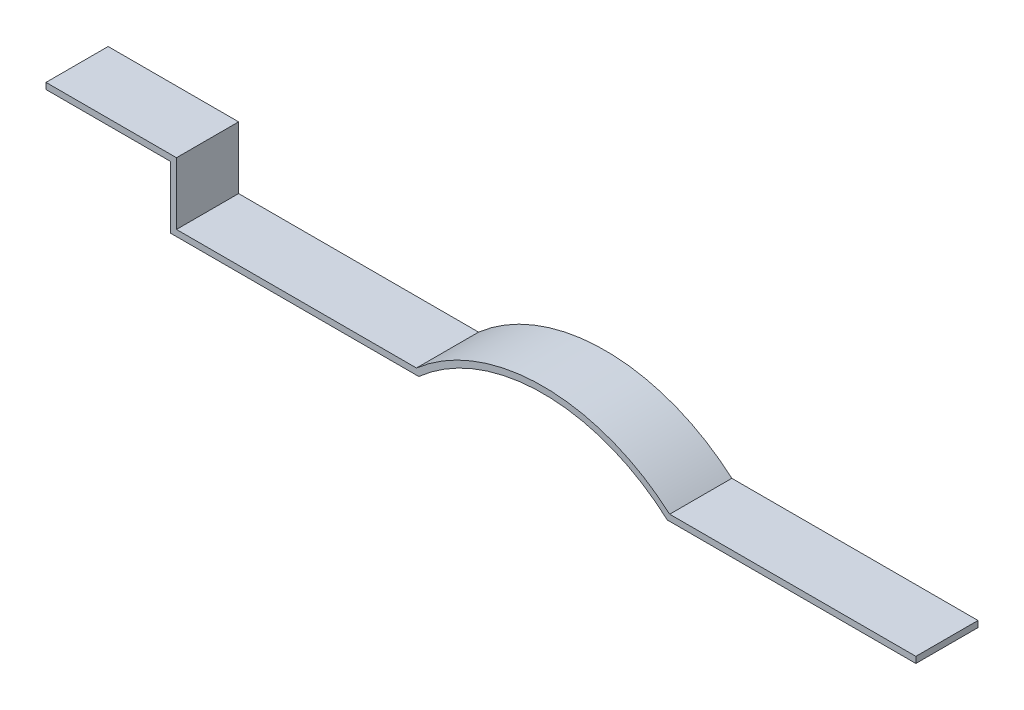
ISO-10303-21;
HEADER;
FILE_DESCRIPTION(('STEP AP214'),'2;1');
FILE_NAME('part.step','',(''),(''),'','','');
FILE_SCHEMA(('AUTOMOTIVE_DESIGN { 1 0 10303 214 1 1 1 1 }'));
ENDSEC;
DATA;
#1=APPLICATION_CONTEXT('core data for automotive mechanical design processes');
#2=APPLICATION_PROTOCOL_DEFINITION('international standard','automotive_design',2000,#1);
#3=PRODUCT_CONTEXT('',#1,'mechanical');
#4=PRODUCT('Part','Part','',(#3));
#5=PRODUCT_RELATED_PRODUCT_CATEGORY('part','',(#4));
#6=PRODUCT_DEFINITION_FORMATION('','',#4);
#7=PRODUCT_DEFINITION_CONTEXT('part definition',#1,'design');
#8=PRODUCT_DEFINITION('design','',#6,#7);
#9=PRODUCT_DEFINITION_SHAPE('','',#8);
#10=(LENGTH_UNIT() NAMED_UNIT(*) SI_UNIT(.MILLI.,.METRE.));
#11=(NAMED_UNIT(*) PLANE_ANGLE_UNIT() SI_UNIT($,.RADIAN.));
#12=(NAMED_UNIT(*) SI_UNIT($,.STERADIAN.) SOLID_ANGLE_UNIT());
#13=UNCERTAINTY_MEASURE_WITH_UNIT(LENGTH_MEASURE(1.E-05),#10,'distance_accuracy_value','');
#14=(GEOMETRIC_REPRESENTATION_CONTEXT(3) GLOBAL_UNCERTAINTY_ASSIGNED_CONTEXT((#13)) GLOBAL_UNIT_ASSIGNED_CONTEXT((#10,
#11,#12)) REPRESENTATION_CONTEXT('',''));
#15=CARTESIAN_POINT('',(0.,0.,0.));
#16=DIRECTION('',(0.,0.,1.));
#17=DIRECTION('',(1.,0.,0.));
#18=AXIS2_PLACEMENT_3D('',#15,#16,#17);
#19=CARTESIAN_POINT('',(0.,5.,50.));
#20=DIRECTION('',(-1.,0.,0.));
#21=DIRECTION('',(0.,0.,1.));
#22=AXIS2_PLACEMENT_3D('',#19,#20,#21);
#23=PLANE('',#22);
#24=DIRECTION('',(0.,1.,0.));
#25=VECTOR('',#24,1.);
#26=CARTESIAN_POINT('',(0.,5.,0.));
#27=LINE('',#26,#25);
#28=CARTESIAN_POINT('',(0.,0.,0.));
#29=VERTEX_POINT('',#28);
#30=CARTESIAN_POINT('',(0.,5.,0.));
#31=VERTEX_POINT('',#30);
#32=EDGE_CURVE('E167',#29,#31,#27,.T.);
#33=ORIENTED_EDGE('',*,*,#32,.T.);
#34=DIRECTION('',(0.,0.,-1.));
#35=VECTOR('',#34,1.);
#36=CARTESIAN_POINT('',(0.,5.,50.));
#37=LINE('',#36,#35);
#38=CARTESIAN_POINT('',(0.,5.,50.));
#39=VERTEX_POINT('',#38);
#40=EDGE_CURVE('E11',#39,#31,#37,.T.);
#41=ORIENTED_EDGE('',*,*,#40,.F.);
#42=DIRECTION('',(0.,1.,0.));
#43=VECTOR('',#42,1.);
#44=CARTESIAN_POINT('',(0.,5.,50.));
#45=LINE('',#44,#43);
#46=CARTESIAN_POINT('',(0.,0.,50.));
#47=VERTEX_POINT('',#46);
#48=EDGE_CURVE('E201',#47,#39,#45,.T.);
#49=ORIENTED_EDGE('',*,*,#48,.F.);
#50=DIRECTION('',(0.,0.,-1.));
#51=VECTOR('',#50,1.);
#52=CARTESIAN_POINT('',(0.,0.,50.));
#53=LINE('',#52,#51);
#54=EDGE_CURVE('E163',#47,#29,#53,.T.);
#55=ORIENTED_EDGE('',*,*,#54,.T.);
#56=EDGE_LOOP('',(#33,#41,#49,#55));
#57=FACE_BOUND('',#56,.T.);
#58=ADVANCED_FACE('F42',(#57),#23,.F.);
#59=CARTESIAN_POINT('',(0.,5.,50.));
#60=DIRECTION('',(0.,-1.,0.));
#61=DIRECTION('',(1.,0.,0.));
#62=AXIS2_PLACEMENT_3D('',#59,#60,#61);
#63=PLANE('',#62);
#64=DIRECTION('',(-1.,0.,0.));
#65=VECTOR('',#64,1.);
#66=CARTESIAN_POINT('',(0.,5.,0.));
#67=LINE('',#66,#65);
#68=CARTESIAN_POINT('',(-198.108066996204,4.99999999999999,0.));
#69=VERTEX_POINT('',#68);
#70=EDGE_CURVE('E171',#31,#69,#67,.T.);
#71=ORIENTED_EDGE('',*,*,#70,.T.);
#72=DIRECTION('',(0.,0.,-1.));
#73=VECTOR('',#72,1.);
#74=CARTESIAN_POINT('',(-198.108066996204,4.99999999999999,50.));
#75=LINE('',#74,#73);
#76=CARTESIAN_POINT('',(-198.108066996204,4.99999999999999,50.));
#77=VERTEX_POINT('',#76);
#78=EDGE_CURVE('E51',#77,#69,#75,.T.);
#79=ORIENTED_EDGE('',*,*,#78,.F.);
#80=DIRECTION('',(-1.,0.,0.));
#81=VECTOR('',#80,1.);
#82=CARTESIAN_POINT('',(0.,5.,50.));
#83=LINE('',#82,#81);
#84=EDGE_CURVE('E114',#39,#77,#83,.T.);
#85=ORIENTED_EDGE('',*,*,#84,.F.);
#86=ORIENTED_EDGE('',*,*,#40,.T.);
#87=EDGE_LOOP('',(#71,#79,#85,#86));
#88=FACE_BOUND('',#87,.T.);
#89=ADVANCED_FACE('F295',(#88),#63,.F.);
#90=CARTESIAN_POINT('',(-300.,-111.803398874989,50.));
#91=DIRECTION('',(0.,0.,-1.));
#92=DIRECTION('',(-1.,0.,0.));
#93=AXIS2_PLACEMENT_3D('',#90,#91,#92);
#94=CYLINDRICAL_SURFACE('',#93,155.);
#95=CARTESIAN_POINT('',(-300.,-111.803398874989,0.));
#96=DIRECTION('',(0.,0.,1.));
#97=DIRECTION('',(-1.,0.,0.));
#98=AXIS2_PLACEMENT_3D('',#95,#96,#97);
#99=CIRCLE('',#98,155.);
#100=CARTESIAN_POINT('',(-401.891933003796,5.,0.));
#101=VERTEX_POINT('',#100);
#102=EDGE_CURVE('E174',#69,#101,#99,.T.);
#103=ORIENTED_EDGE('',*,*,#102,.T.);
#104=DIRECTION('',(0.,0.,-1.));
#105=VECTOR('',#104,1.);
#106=CARTESIAN_POINT('',(-401.891933003796,5.,50.));
#107=LINE('',#106,#105);
#108=CARTESIAN_POINT('',(-401.891933003796,5.,50.));
#109=VERTEX_POINT('',#108);
#110=EDGE_CURVE('E228',#109,#101,#107,.T.);
#111=ORIENTED_EDGE('',*,*,#110,.F.);
#112=CARTESIAN_POINT('',(-300.,-111.803398874989,50.));
#113=DIRECTION('',(0.,0.,1.));
#114=DIRECTION('',(-1.,0.,0.));
#115=AXIS2_PLACEMENT_3D('',#112,#113,#114);
#116=CIRCLE('',#115,155.);
#117=EDGE_CURVE('E238',#77,#109,#116,.T.);
#118=ORIENTED_EDGE('',*,*,#117,.F.);
#119=ORIENTED_EDGE('',*,*,#78,.T.);
#120=EDGE_LOOP('',(#103,#111,#118,#119));
#121=FACE_BOUND('',#120,.T.);
#122=ADVANCED_FACE('F236',(#121),#94,.T.);
#123=CARTESIAN_POINT('',(-401.891933003796,5.,50.));
#124=DIRECTION('',(0.,-1.,0.));
#125=DIRECTION('',(1.,0.,0.));
#126=AXIS2_PLACEMENT_3D('',#123,#124,#125);
#127=PLANE('',#126);
#128=DIRECTION('',(-1.,0.,0.));
#129=VECTOR('',#128,1.);
#130=CARTESIAN_POINT('',(-401.891933003796,5.,0.));
#131=LINE('',#130,#129);
#132=CARTESIAN_POINT('',(-595.,5.,0.));
#133=VERTEX_POINT('',#132);
#134=EDGE_CURVE('E177',#101,#133,#131,.T.);
#135=ORIENTED_EDGE('',*,*,#134,.T.);
#136=DIRECTION('',(0.,0.,-1.));
#137=VECTOR('',#136,1.);
#138=CARTESIAN_POINT('',(-595.,5.,50.));
#139=LINE('',#138,#137);
#140=CARTESIAN_POINT('',(-595.,5.,50.));
#141=VERTEX_POINT('',#140);
#142=EDGE_CURVE('E224',#141,#133,#139,.T.);
#143=ORIENTED_EDGE('',*,*,#142,.F.);
#144=DIRECTION('',(-1.,0.,0.));
#145=VECTOR('',#144,1.);
#146=CARTESIAN_POINT('',(-401.891933003796,5.,50.));
#147=LINE('',#146,#145);
#148=EDGE_CURVE('E257',#109,#141,#147,.T.);
#149=ORIENTED_EDGE('',*,*,#148,.F.);
#150=ORIENTED_EDGE('',*,*,#110,.T.);
#151=EDGE_LOOP('',(#135,#143,#149,#150));
#152=FACE_BOUND('',#151,.T.);
#153=ADVANCED_FACE('F247',(#152),#127,.F.);
#154=CARTESIAN_POINT('',(-595.,5.,50.));
#155=DIRECTION('',(-1.,0.,0.));
#156=DIRECTION('',(0.,0.,1.));
#157=AXIS2_PLACEMENT_3D('',#154,#155,#156);
#158=PLANE('',#157);
#159=DIRECTION('',(0.,1.,0.));
#160=VECTOR('',#159,1.);
#161=CARTESIAN_POINT('',(-595.,5.,0.));
#162=LINE('',#161,#160);
#163=CARTESIAN_POINT('',(-595.,55.,0.));
#164=VERTEX_POINT('',#163);
#165=EDGE_CURVE('E180',#133,#164,#162,.T.);
#166=ORIENTED_EDGE('',*,*,#165,.T.);
#167=DIRECTION('',(0.,0.,-1.));
#168=VECTOR('',#167,1.);
#169=CARTESIAN_POINT('',(-595.,55.,50.));
#170=LINE('',#169,#168);
#171=CARTESIAN_POINT('',(-595.,55.,50.));
#172=VERTEX_POINT('',#171);
#173=EDGE_CURVE('E220',#172,#164,#170,.T.);
#174=ORIENTED_EDGE('',*,*,#173,.F.);
#175=DIRECTION('',(0.,1.,0.));
#176=VECTOR('',#175,1.);
#177=CARTESIAN_POINT('',(-595.,5.,50.));
#178=LINE('',#177,#176);
#179=EDGE_CURVE('E253',#141,#172,#178,.T.);
#180=ORIENTED_EDGE('',*,*,#179,.F.);
#181=ORIENTED_EDGE('',*,*,#142,.T.);
#182=EDGE_LOOP('',(#166,#174,#180,#181));
#183=FACE_BOUND('',#182,.T.);
#184=ADVANCED_FACE('F251',(#183),#158,.F.);
#185=CARTESIAN_POINT('',(-595.,55.,50.));
#186=DIRECTION('',(0.,-1.,0.));
#187=DIRECTION('',(1.,0.,0.));
#188=AXIS2_PLACEMENT_3D('',#185,#186,#187);
#189=PLANE('',#188);
#190=DIRECTION('',(-1.,0.,0.));
#191=VECTOR('',#190,1.);
#192=CARTESIAN_POINT('',(-595.,55.,0.));
#193=LINE('',#192,#191);
#194=CARTESIAN_POINT('',(-700.,55.,0.));
#195=VERTEX_POINT('',#194);
#196=EDGE_CURVE('E183',#164,#195,#193,.T.);
#197=ORIENTED_EDGE('',*,*,#196,.T.);
#198=DIRECTION('',(0.,0.,-1.));
#199=VECTOR('',#198,1.);
#200=CARTESIAN_POINT('',(-700.,55.,50.));
#201=LINE('',#200,#199);
#202=CARTESIAN_POINT('',(-700.,55.,50.));
#203=VERTEX_POINT('',#202);
#204=EDGE_CURVE('E216',#203,#195,#201,.T.);
#205=ORIENTED_EDGE('',*,*,#204,.F.);
#206=DIRECTION('',(-1.,0.,0.));
#207=VECTOR('',#206,1.);
#208=CARTESIAN_POINT('',(-595.,55.,50.));
#209=LINE('',#208,#207);
#210=EDGE_CURVE('E256',#172,#203,#209,.T.);
#211=ORIENTED_EDGE('',*,*,#210,.F.);
#212=ORIENTED_EDGE('',*,*,#173,.T.);
#213=EDGE_LOOP('',(#197,#205,#211,#212));
#214=FACE_BOUND('',#213,.T.);
#215=ADVANCED_FACE('F308',(#214),#189,.F.);
#216=CARTESIAN_POINT('',(-700.,50.,50.));
#217=DIRECTION('',(1.,0.,0.));
#218=DIRECTION('',(0.,0.,-1.));
#219=AXIS2_PLACEMENT_3D('',#216,#217,#218);
#220=PLANE('',#219);
#221=DIRECTION('',(0.,-1.,0.));
#222=VECTOR('',#221,1.);
#223=CARTESIAN_POINT('',(-700.,50.,0.));
#224=LINE('',#223,#222);
#225=CARTESIAN_POINT('',(-700.,50.,0.));
#226=VERTEX_POINT('',#225);
#227=EDGE_CURVE('E186',#195,#226,#224,.T.);
#228=ORIENTED_EDGE('',*,*,#227,.T.);
#229=DIRECTION('',(0.,0.,-1.));
#230=VECTOR('',#229,1.);
#231=CARTESIAN_POINT('',(-700.,50.,50.));
#232=LINE('',#231,#230);
#233=CARTESIAN_POINT('',(-700.,50.,50.));
#234=VERTEX_POINT('',#233);
#235=EDGE_CURVE('E212',#234,#226,#232,.T.);
#236=ORIENTED_EDGE('',*,*,#235,.F.);
#237=DIRECTION('',(0.,-1.,0.));
#238=VECTOR('',#237,1.);
#239=CARTESIAN_POINT('',(-700.,50.,50.));
#240=LINE('',#239,#238);
#241=EDGE_CURVE('E261',#203,#234,#240,.T.);
#242=ORIENTED_EDGE('',*,*,#241,.F.);
#243=ORIENTED_EDGE('',*,*,#204,.T.);
#244=EDGE_LOOP('',(#228,#236,#242,#243));
#245=FACE_BOUND('',#244,.T.);
#246=ADVANCED_FACE('F311',(#245),#220,.F.);
#247=CARTESIAN_POINT('',(-600.,50.,50.));
#248=DIRECTION('',(0.,1.,0.));
#249=DIRECTION('',(-1.,0.,0.));
#250=AXIS2_PLACEMENT_3D('',#247,#248,#249);
#251=PLANE('',#250);
#252=DIRECTION('',(1.,0.,0.));
#253=VECTOR('',#252,1.);
#254=CARTESIAN_POINT('',(-600.,50.,0.));
#255=LINE('',#254,#253);
#256=CARTESIAN_POINT('',(-600.,50.,0.));
#257=VERTEX_POINT('',#256);
#258=EDGE_CURVE('E189',#226,#257,#255,.T.);
#259=ORIENTED_EDGE('',*,*,#258,.T.);
#260=DIRECTION('',(0.,0.,-1.));
#261=VECTOR('',#260,1.);
#262=CARTESIAN_POINT('',(-600.,50.,50.));
#263=LINE('',#262,#261);
#264=CARTESIAN_POINT('',(-600.,50.,50.));
#265=VERTEX_POINT('',#264);
#266=EDGE_CURVE('E208',#265,#257,#263,.T.);
#267=ORIENTED_EDGE('',*,*,#266,.F.);
#268=DIRECTION('',(1.,0.,0.));
#269=VECTOR('',#268,1.);
#270=CARTESIAN_POINT('',(-600.,50.,50.));
#271=LINE('',#270,#269);
#272=EDGE_CURVE('E268',#234,#265,#271,.T.);
#273=ORIENTED_EDGE('',*,*,#272,.F.);
#274=ORIENTED_EDGE('',*,*,#235,.T.);
#275=EDGE_LOOP('',(#259,#267,#273,#274));
#276=FACE_BOUND('',#275,.T.);
#277=ADVANCED_FACE('F276',(#276),#251,.F.);
#278=CARTESIAN_POINT('',(-600.,0.,50.));
#279=DIRECTION('',(1.,0.,0.));
#280=DIRECTION('',(0.,0.,-1.));
#281=AXIS2_PLACEMENT_3D('',#278,#279,#280);
#282=PLANE('',#281);
#283=DIRECTION('',(0.,-1.,0.));
#284=VECTOR('',#283,1.);
#285=CARTESIAN_POINT('',(-600.,0.,0.));
#286=LINE('',#285,#284);
#287=CARTESIAN_POINT('',(-600.,0.,0.));
#288=VERTEX_POINT('',#287);
#289=EDGE_CURVE('E192',#257,#288,#286,.T.);
#290=ORIENTED_EDGE('',*,*,#289,.T.);
#291=DIRECTION('',(0.,0.,-1.));
#292=VECTOR('',#291,1.);
#293=CARTESIAN_POINT('',(-600.,0.,50.));
#294=LINE('',#293,#292);
#295=CARTESIAN_POINT('',(-600.,0.,50.));
#296=VERTEX_POINT('',#295);
#297=EDGE_CURVE('E156',#296,#288,#294,.T.);
#298=ORIENTED_EDGE('',*,*,#297,.F.);
#299=DIRECTION('',(0.,-1.,0.));
#300=VECTOR('',#299,1.);
#301=CARTESIAN_POINT('',(-600.,0.,50.));
#302=LINE('',#301,#300);
#303=EDGE_CURVE('E145',#265,#296,#302,.T.);
#304=ORIENTED_EDGE('',*,*,#303,.F.);
#305=ORIENTED_EDGE('',*,*,#266,.T.);
#306=EDGE_LOOP('',(#290,#298,#304,#305));
#307=FACE_BOUND('',#306,.T.);
#308=ADVANCED_FACE('F280',(#307),#282,.F.);
#309=CARTESIAN_POINT('',(-400.,0.,50.));
#310=DIRECTION('',(0.,1.,0.));
#311=DIRECTION('',(-1.,0.,0.));
#312=AXIS2_PLACEMENT_3D('',#309,#310,#311);
#313=PLANE('',#312);
#314=DIRECTION('',(1.,0.,0.));
#315=VECTOR('',#314,1.);
#316=CARTESIAN_POINT('',(-400.,0.,0.));
#317=LINE('',#316,#315);
#318=CARTESIAN_POINT('',(-400.,0.,0.));
#319=VERTEX_POINT('',#318);
#320=EDGE_CURVE('E154',#288,#319,#317,.T.);
#321=ORIENTED_EDGE('',*,*,#320,.T.);
#322=DIRECTION('',(0.,0.,-1.));
#323=VECTOR('',#322,1.);
#324=CARTESIAN_POINT('',(-400.,0.,50.));
#325=LINE('',#324,#323);
#326=CARTESIAN_POINT('',(-400.,0.,50.));
#327=VERTEX_POINT('',#326);
#328=EDGE_CURVE('E151',#327,#319,#325,.T.);
#329=ORIENTED_EDGE('',*,*,#328,.F.);
#330=DIRECTION('',(1.,0.,0.));
#331=VECTOR('',#330,1.);
#332=CARTESIAN_POINT('',(-400.,0.,50.));
#333=LINE('',#332,#331);
#334=EDGE_CURVE('E139',#296,#327,#333,.T.);
#335=ORIENTED_EDGE('',*,*,#334,.F.);
#336=ORIENTED_EDGE('',*,*,#297,.T.);
#337=EDGE_LOOP('',(#321,#329,#335,#336));
#338=FACE_BOUND('',#337,.T.);
#339=ADVANCED_FACE('F152',(#338),#313,.F.);
#340=CARTESIAN_POINT('',(-300.,-111.803398874989,50.));
#341=DIRECTION('',(0.,0.,-1.));
#342=DIRECTION('',(-1.,0.,0.));
#343=AXIS2_PLACEMENT_3D('',#340,#341,#342);
#344=CYLINDRICAL_SURFACE('',#343,150.);
#345=CARTESIAN_POINT('',(-300.,-111.803398874989,0.));
#346=DIRECTION('',(0.,0.,-1.));
#347=DIRECTION('',(-1.,0.,0.));
#348=AXIS2_PLACEMENT_3D('',#345,#346,#347);
#349=CIRCLE('',#348,150.);
#350=CARTESIAN_POINT('',(-200.,0.,0.));
#351=VERTEX_POINT('',#350);
#352=EDGE_CURVE('E100',#319,#351,#349,.T.);
#353=ORIENTED_EDGE('',*,*,#352,.T.);
#354=DIRECTION('',(0.,0.,-1.));
#355=VECTOR('',#354,1.);
#356=CARTESIAN_POINT('',(-200.,0.,50.));
#357=LINE('',#356,#355);
#358=CARTESIAN_POINT('',(-200.,0.,50.));
#359=VERTEX_POINT('',#358);
#360=EDGE_CURVE('E157',#359,#351,#357,.T.);
#361=ORIENTED_EDGE('',*,*,#360,.F.);
#362=CARTESIAN_POINT('',(-300.,-111.803398874989,50.));
#363=DIRECTION('',(0.,0.,-1.));
#364=DIRECTION('',(-1.,0.,0.));
#365=AXIS2_PLACEMENT_3D('',#362,#363,#364);
#366=CIRCLE('',#365,150.);
#367=EDGE_CURVE('E143',#327,#359,#366,.T.);
#368=ORIENTED_EDGE('',*,*,#367,.F.);
#369=ORIENTED_EDGE('',*,*,#328,.T.);
#370=EDGE_LOOP('',(#353,#361,#368,#369));
#371=FACE_BOUND('',#370,.T.);
#372=ADVANCED_FACE('F159',(#371),#344,.F.);
#373=CARTESIAN_POINT('',(0.,0.,50.));
#374=DIRECTION('',(0.,1.,0.));
#375=DIRECTION('',(0.,0.,1.));
#376=AXIS2_PLACEMENT_3D('',#373,#374,#375);
#377=PLANE('',#376);
#378=DIRECTION('',(1.,0.,0.));
#379=VECTOR('',#378,1.);
#380=CARTESIAN_POINT('',(0.,0.,0.));
#381=LINE('',#380,#379);
#382=EDGE_CURVE('E106',#351,#29,#381,.T.);
#383=ORIENTED_EDGE('',*,*,#382,.T.);
#384=ORIENTED_EDGE('',*,*,#54,.F.);
#385=DIRECTION('',(1.,0.,0.));
#386=VECTOR('',#385,1.);
#387=CARTESIAN_POINT('',(0.,0.,50.));
#388=LINE('',#387,#386);
#389=EDGE_CURVE('E59',#359,#47,#388,.T.);
#390=ORIENTED_EDGE('',*,*,#389,.F.);
#391=ORIENTED_EDGE('',*,*,#360,.T.);
#392=EDGE_LOOP('',(#383,#384,#390,#391));
#393=FACE_BOUND('',#392,.T.);
#394=ADVANCED_FACE('F284',(#393),#377,.F.);
#395=CARTESIAN_POINT('',(-300.,-111.803398874989,50.));
#396=DIRECTION('',(0.,0.,-1.));
#397=DIRECTION('',(-1.,0.,0.));
#398=AXIS2_PLACEMENT_3D('',#395,#396,#397);
#399=PLANE('',#398);
#400=ORIENTED_EDGE('',*,*,#48,.T.);
#401=ORIENTED_EDGE('',*,*,#84,.T.);
#402=ORIENTED_EDGE('',*,*,#117,.T.);
#403=ORIENTED_EDGE('',*,*,#148,.T.);
#404=ORIENTED_EDGE('',*,*,#179,.T.);
#405=ORIENTED_EDGE('',*,*,#210,.T.);
#406=ORIENTED_EDGE('',*,*,#241,.T.);
#407=ORIENTED_EDGE('',*,*,#272,.T.);
#408=ORIENTED_EDGE('',*,*,#303,.T.);
#409=ORIENTED_EDGE('',*,*,#334,.T.);
#410=ORIENTED_EDGE('',*,*,#367,.T.);
#411=ORIENTED_EDGE('',*,*,#389,.T.);
#412=EDGE_LOOP('',(#400,#401,#402,#403,#404,#405,#406,#407,#408,#409,#410,#411));
#413=FACE_BOUND('',#412,.T.);
#414=ADVANCED_FACE('F141',(#413),#399,.F.);
#415=CARTESIAN_POINT('',(-300.,-111.803398874989,0.));
#416=DIRECTION('',(0.,0.,-1.));
#417=DIRECTION('',(-1.,0.,0.));
#418=AXIS2_PLACEMENT_3D('',#415,#416,#417);
#419=PLANE('',#418);
#420=ORIENTED_EDGE('',*,*,#32,.F.);
#421=ORIENTED_EDGE('',*,*,#382,.F.);
#422=ORIENTED_EDGE('',*,*,#352,.F.);
#423=ORIENTED_EDGE('',*,*,#320,.F.);
#424=ORIENTED_EDGE('',*,*,#289,.F.);
#425=ORIENTED_EDGE('',*,*,#258,.F.);
#426=ORIENTED_EDGE('',*,*,#227,.F.);
#427=ORIENTED_EDGE('',*,*,#196,.F.);
#428=ORIENTED_EDGE('',*,*,#165,.F.);
#429=ORIENTED_EDGE('',*,*,#134,.F.);
#430=ORIENTED_EDGE('',*,*,#102,.F.);
#431=ORIENTED_EDGE('',*,*,#70,.F.);
#432=EDGE_LOOP('',(#420,#421,#422,#423,#424,#425,#426,#427,#428,#429,#430,#431));
#433=FACE_BOUND('',#432,.T.);
#434=ADVANCED_FACE('F242',(#433),#419,.T.);
#435=CLOSED_SHELL('',(#58,#89,#122,#153,#184,#215,#246,#277,#308,#339,#372,#394,#414,#434));
#436=MANIFOLD_SOLID_BREP('B2',#435);
#437=ADVANCED_BREP_SHAPE_REPRESENTATION('',(#18,#436),#14);
#438=SHAPE_DEFINITION_REPRESENTATION(#9,#437);
ENDSEC;
END-ISO-10303-21;
